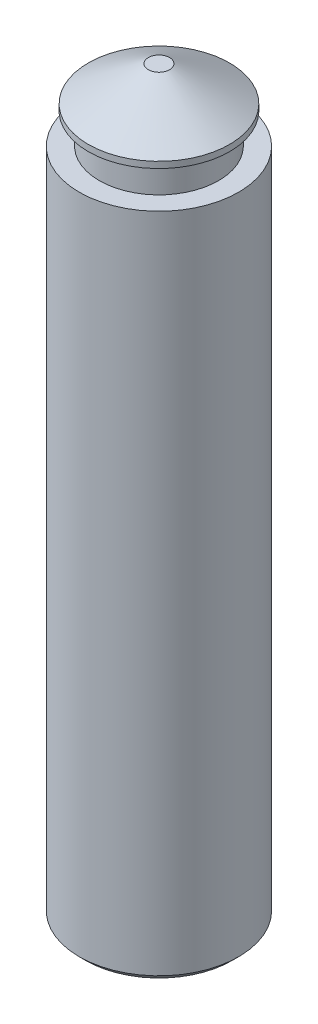
ISO-10303-21;
HEADER;
FILE_DESCRIPTION(('STEP AP214'),'2;1');
FILE_NAME('part.step','',(''),(''),'','','');
FILE_SCHEMA(('AUTOMOTIVE_DESIGN { 1 0 10303 214 1 1 1 1 }'));
ENDSEC;
DATA;
#1=APPLICATION_CONTEXT('core data for automotive mechanical design processes');
#2=APPLICATION_PROTOCOL_DEFINITION('international standard','automotive_design',2000,#1);
#3=PRODUCT_CONTEXT('',#1,'mechanical');
#4=PRODUCT('Part','Part','',(#3));
#5=PRODUCT_RELATED_PRODUCT_CATEGORY('part','',(#4));
#6=PRODUCT_DEFINITION_FORMATION('','',#4);
#7=PRODUCT_DEFINITION_CONTEXT('part definition',#1,'design');
#8=PRODUCT_DEFINITION('design','',#6,#7);
#9=PRODUCT_DEFINITION_SHAPE('','',#8);
#10=(LENGTH_UNIT() NAMED_UNIT(*) SI_UNIT(.MILLI.,.METRE.));
#11=(NAMED_UNIT(*) PLANE_ANGLE_UNIT() SI_UNIT($,.RADIAN.));
#12=(NAMED_UNIT(*) SI_UNIT($,.STERADIAN.) SOLID_ANGLE_UNIT());
#13=UNCERTAINTY_MEASURE_WITH_UNIT(LENGTH_MEASURE(1.E-05),#10,'distance_accuracy_value','');
#14=(GEOMETRIC_REPRESENTATION_CONTEXT(3) GLOBAL_UNCERTAINTY_ASSIGNED_CONTEXT((#13)) GLOBAL_UNIT_ASSIGNED_CONTEXT((#10,
#11,#12)) REPRESENTATION_CONTEXT('',''));
#15=CARTESIAN_POINT('',(0.,0.,0.));
#16=DIRECTION('',(0.,0.,1.));
#17=DIRECTION('',(1.,0.,0.));
#18=AXIS2_PLACEMENT_3D('',#15,#16,#17);
#19=CARTESIAN_POINT('',(0.,155.575,0.));
#20=DIRECTION('',(0.,-1.,0.));
#21=DIRECTION('',(0.,0.,-1.));
#22=AXIS2_PLACEMENT_3D('',#19,#20,#21);
#23=CYLINDRICAL_SURFACE('',#22,18.542);
#24=CARTESIAN_POINT('',(0.,1.52400000000003,0.));
#25=DIRECTION('',(0.,1.,0.));
#26=DIRECTION('',(0.,0.,1.));
#27=AXIS2_PLACEMENT_3D('',#24,#25,#26);
#28=CIRCLE('',#27,18.542);
#29=CARTESIAN_POINT('',(0.,1.52400000000003,18.542));
#30=VERTEX_POINT('',#29);
#31=EDGE_CURVE('E39',#30,#30,#28,.T.);
#32=ORIENTED_EDGE('',*,*,#31,.T.);
#33=EDGE_LOOP('',(#32));
#34=FACE_BOUND('',#33,.T.);
#35=CARTESIAN_POINT('',(0.,155.575,0.));
#36=DIRECTION('',(0.,1.,0.));
#37=DIRECTION('',(0.,0.,1.));
#38=AXIS2_PLACEMENT_3D('',#35,#36,#37);
#39=CIRCLE('',#38,18.542);
#40=CARTESIAN_POINT('',(0.,155.575,18.542));
#41=VERTEX_POINT('',#40);
#42=EDGE_CURVE('E52',#41,#41,#39,.T.);
#43=ORIENTED_EDGE('',*,*,#42,.F.);
#44=EDGE_LOOP('',(#43));
#45=FACE_BOUND('',#44,.T.);
#46=ADVANCED_FACE('F32',(#34,#45),#23,.T.);
#47=CARTESIAN_POINT('',(0.,155.575,0.));
#48=DIRECTION('',(0.,1.,0.));
#49=DIRECTION('',(0.,0.,1.));
#50=AXIS2_PLACEMENT_3D('',#47,#48,#49);
#51=PLANE('',#50);
#52=CARTESIAN_POINT('',(0.,155.575,0.));
#53=DIRECTION('',(0.,1.,0.));
#54=DIRECTION('',(0.,0.,1.));
#55=AXIS2_PLACEMENT_3D('',#52,#53,#54);
#56=CIRCLE('',#55,13.8811);
#57=CARTESIAN_POINT('',(0.,155.575,13.8811));
#58=VERTEX_POINT('',#57);
#59=EDGE_CURVE('E56',#58,#58,#56,.T.);
#60=ORIENTED_EDGE('',*,*,#59,.F.);
#61=EDGE_LOOP('',(#60));
#62=FACE_BOUND('',#61,.T.);
#63=ORIENTED_EDGE('',*,*,#42,.T.);
#64=EDGE_LOOP('',(#63));
#65=FACE_BOUND('',#64,.T.);
#66=ADVANCED_FACE('F82',(#62,#65),#51,.T.);
#67=CARTESIAN_POINT('',(0.,0.,0.));
#68=DIRECTION('',(0.,1.,0.));
#69=DIRECTION('',(0.,0.,1.));
#70=AXIS2_PLACEMENT_3D('',#67,#68,#69);
#71=PLANE('',#70);
#72=CARTESIAN_POINT('',(0.,0.,0.));
#73=DIRECTION('',(0.,1.,0.));
#74=DIRECTION('',(0.,0.,1.));
#75=AXIS2_PLACEMENT_3D('',#72,#73,#74);
#76=CIRCLE('',#75,17.018);
#77=CARTESIAN_POINT('',(0.,0.,17.018));
#78=VERTEX_POINT('',#77);
#79=EDGE_CURVE('E10',#78,#78,#76,.F.);
#80=ORIENTED_EDGE('',*,*,#79,.T.);
#81=EDGE_LOOP('',(#80));
#82=FACE_BOUND('',#81,.T.);
#83=ADVANCED_FACE('F87',(#82),#71,.F.);
#84=CARTESIAN_POINT('',(0.,162.687,0.));
#85=DIRECTION('',(0.,-1.,0.));
#86=DIRECTION('',(0.,0.,-1.));
#87=AXIS2_PLACEMENT_3D('',#84,#85,#86);
#88=CYLINDRICAL_SURFACE('',#87,13.8811);
#89=CARTESIAN_POINT('',(0.,162.687,0.));
#90=DIRECTION('',(0.,1.,0.));
#91=DIRECTION('',(0.,0.,1.));
#92=AXIS2_PLACEMENT_3D('',#89,#90,#91);
#93=CIRCLE('',#92,13.8811);
#94=CARTESIAN_POINT('',(0.,162.687,13.8811));
#95=VERTEX_POINT('',#94);
#96=EDGE_CURVE('E55',#95,#95,#93,.T.);
#97=ORIENTED_EDGE('',*,*,#96,.F.);
#98=EDGE_LOOP('',(#97));
#99=FACE_BOUND('',#98,.T.);
#100=ORIENTED_EDGE('',*,*,#59,.T.);
#101=EDGE_LOOP('',(#100));
#102=FACE_BOUND('',#101,.T.);
#103=ADVANCED_FACE('F93',(#99,#102),#88,.T.);
#104=CARTESIAN_POINT('',(0.,172.212,0.));
#105=DIRECTION('',(0.,-1.,0.));
#106=DIRECTION('',(0.,0.,-1.));
#107=AXIS2_PLACEMENT_3D('',#104,#105,#106);
#108=CYLINDRICAL_SURFACE('',#107,16.4338);
#109=CARTESIAN_POINT('',(0.,164.146416739421,0.));
#110=DIRECTION('',(0.,1.,0.));
#111=DIRECTION('',(0.,0.,1.));
#112=AXIS2_PLACEMENT_3D('',#109,#110,#111);
#113=CIRCLE('',#112,16.4338);
#114=CARTESIAN_POINT('',(0.,164.146416739421,16.4338));
#115=VERTEX_POINT('',#114);
#116=EDGE_CURVE('E43',#115,#115,#113,.F.);
#117=ORIENTED_EDGE('',*,*,#116,.T.);
#118=EDGE_LOOP('',(#117));
#119=FACE_BOUND('',#118,.T.);
#120=CARTESIAN_POINT('',(0.,162.687,0.));
#121=DIRECTION('',(0.,1.,0.));
#122=DIRECTION('',(0.,0.,1.));
#123=AXIS2_PLACEMENT_3D('',#120,#121,#122);
#124=CIRCLE('',#123,16.4338);
#125=CARTESIAN_POINT('',(0.,162.687,16.4338));
#126=VERTEX_POINT('',#125);
#127=EDGE_CURVE('E59',#126,#126,#124,.T.);
#128=ORIENTED_EDGE('',*,*,#127,.T.);
#129=EDGE_LOOP('',(#128));
#130=FACE_BOUND('',#129,.T.);
#131=ADVANCED_FACE('F65',(#119,#130),#108,.T.);
#132=CARTESIAN_POINT('',(0.,172.212,0.));
#133=DIRECTION('',(0.,1.,0.));
#134=DIRECTION('',(0.,0.,1.));
#135=AXIS2_PLACEMENT_3D('',#132,#133,#134);
#136=PLANE('',#135);
#137=CARTESIAN_POINT('',(0.,172.212,0.));
#138=DIRECTION('',(0.,1.,0.));
#139=DIRECTION('',(0.,0.,1.));
#140=AXIS2_PLACEMENT_3D('',#137,#138,#139);
#141=CIRCLE('',#140,2.46379999999985);
#142=CARTESIAN_POINT('',(0.,172.212,2.46379999999985));
#143=VERTEX_POINT('',#142);
#144=EDGE_CURVE('E47',#143,#143,#141,.T.);
#145=ORIENTED_EDGE('',*,*,#144,.T.);
#146=EDGE_LOOP('',(#145));
#147=FACE_BOUND('',#146,.T.);
#148=ADVANCED_FACE('F70',(#147),#136,.T.);
#149=CARTESIAN_POINT('',(0.,162.687,0.));
#150=DIRECTION('',(0.,1.,0.));
#151=DIRECTION('',(0.,0.,1.));
#152=AXIS2_PLACEMENT_3D('',#149,#150,#151);
#153=PLANE('',#152);
#154=ORIENTED_EDGE('',*,*,#96,.T.);
#155=EDGE_LOOP('',(#154));
#156=FACE_BOUND('',#155,.T.);
#157=ORIENTED_EDGE('',*,*,#127,.F.);
#158=EDGE_LOOP('',(#157));
#159=FACE_BOUND('',#158,.T.);
#160=ADVANCED_FACE('F67',(#156,#159),#153,.F.);
#161=CARTESIAN_POINT('',(0.,172.212,0.));
#162=DIRECTION('',(0.,-1.,0.));
#163=DIRECTION('',(0.,0.,-1.));
#164=AXIS2_PLACEMENT_3D('',#161,#162,#163);
#165=CONICAL_SURFACE('',#164,2.46379999999985,1.0471975511966);
#166=ORIENTED_EDGE('',*,*,#116,.F.);
#167=EDGE_LOOP('',(#166));
#168=FACE_BOUND('',#167,.T.);
#169=ORIENTED_EDGE('',*,*,#144,.F.);
#170=EDGE_LOOP('',(#169));
#171=FACE_BOUND('',#170,.T.);
#172=ADVANCED_FACE('F69',(#168,#171),#165,.T.);
#173=CARTESIAN_POINT('',(0.,1.52400000000003,0.));
#174=DIRECTION('',(0.,1.,0.));
#175=DIRECTION('',(0.,0.,1.));
#176=AXIS2_PLACEMENT_3D('',#173,#174,#175);
#177=CONICAL_SURFACE('',#176,18.542,0.785398163397446);
#178=ORIENTED_EDGE('',*,*,#79,.F.);
#179=EDGE_LOOP('',(#178));
#180=FACE_BOUND('',#179,.T.);
#181=ORIENTED_EDGE('',*,*,#31,.F.);
#182=EDGE_LOOP('',(#181));
#183=FACE_BOUND('',#182,.T.);
#184=ADVANCED_FACE('F34',(#180,#183),#177,.T.);
#185=CLOSED_SHELL('',(#46,#66,#83,#103,#131,#148,#160,#172,#184));
#186=MANIFOLD_SOLID_BREP('B2',#185);
#187=ADVANCED_BREP_SHAPE_REPRESENTATION('',(#18,#186),#14);
#188=SHAPE_DEFINITION_REPRESENTATION(#9,#187);
ENDSEC;
END-ISO-10303-21;
